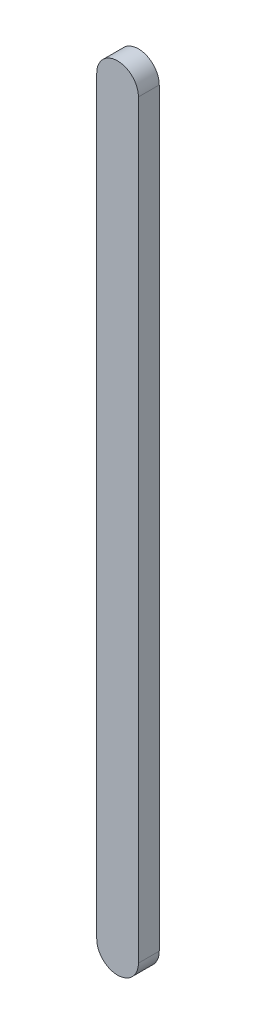
ISO-10303-21;
HEADER;
FILE_DESCRIPTION(('STEP AP214'),'2;1');
FILE_NAME('part.step','',(''),(''),'','','');
FILE_SCHEMA(('AUTOMOTIVE_DESIGN { 1 0 10303 214 1 1 1 1 }'));
ENDSEC;
DATA;
#1=APPLICATION_CONTEXT('core data for automotive mechanical design processes');
#2=APPLICATION_PROTOCOL_DEFINITION('international standard','automotive_design',2000,#1);
#3=PRODUCT_CONTEXT('',#1,'mechanical');
#4=PRODUCT('Part','Part','',(#3));
#5=PRODUCT_RELATED_PRODUCT_CATEGORY('part','',(#4));
#6=PRODUCT_DEFINITION_FORMATION('','',#4);
#7=PRODUCT_DEFINITION_CONTEXT('part definition',#1,'design');
#8=PRODUCT_DEFINITION('design','',#6,#7);
#9=PRODUCT_DEFINITION_SHAPE('','',#8);
#10=(LENGTH_UNIT() NAMED_UNIT(*) SI_UNIT(.MILLI.,.METRE.));
#11=(NAMED_UNIT(*) PLANE_ANGLE_UNIT() SI_UNIT($,.RADIAN.));
#12=(NAMED_UNIT(*) SI_UNIT($,.STERADIAN.) SOLID_ANGLE_UNIT());
#13=UNCERTAINTY_MEASURE_WITH_UNIT(LENGTH_MEASURE(1.E-05),#10,'distance_accuracy_value','');
#14=(GEOMETRIC_REPRESENTATION_CONTEXT(3) GLOBAL_UNCERTAINTY_ASSIGNED_CONTEXT((#13)) GLOBAL_UNIT_ASSIGNED_CONTEXT((#10,
#11,#12)) REPRESENTATION_CONTEXT('',''));
#15=CARTESIAN_POINT('',(0.,0.,0.));
#16=DIRECTION('',(0.,0.,1.));
#17=DIRECTION('',(1.,0.,0.));
#18=AXIS2_PLACEMENT_3D('',#15,#16,#17);
#19=CARTESIAN_POINT('',(0.,0.,5.));
#20=DIRECTION('',(0.,0.,-1.));
#21=DIRECTION('',(-1.,0.,0.));
#22=AXIS2_PLACEMENT_3D('',#19,#20,#21);
#23=CYLINDRICAL_SURFACE('',#22,5.);
#24=CARTESIAN_POINT('',(0.,0.,0.));
#25=DIRECTION('',(0.,0.,1.));
#26=DIRECTION('',(1.,0.,0.));
#27=AXIS2_PLACEMENT_3D('',#24,#25,#26);
#28=CIRCLE('',#27,5.);
#29=CARTESIAN_POINT('',(5.,0.,0.));
#30=VERTEX_POINT('',#29);
#31=CARTESIAN_POINT('',(-5.,0.,0.));
#32=VERTEX_POINT('',#31);
#33=EDGE_CURVE('E107',#30,#32,#28,.T.);
#34=ORIENTED_EDGE('',*,*,#33,.T.);
#35=DIRECTION('',(0.,0.,-1.));
#36=VECTOR('',#35,1.);
#37=CARTESIAN_POINT('',(-5.,0.,5.));
#38=LINE('',#37,#36);
#39=CARTESIAN_POINT('',(-5.,0.,5.));
#40=VERTEX_POINT('',#39);
#41=EDGE_CURVE('E11',#40,#32,#38,.T.);
#42=ORIENTED_EDGE('',*,*,#41,.F.);
#43=CARTESIAN_POINT('',(0.,0.,5.));
#44=DIRECTION('',(0.,0.,1.));
#45=DIRECTION('',(1.,0.,0.));
#46=AXIS2_PLACEMENT_3D('',#43,#44,#45);
#47=CIRCLE('',#46,5.);
#48=CARTESIAN_POINT('',(5.,0.,5.));
#49=VERTEX_POINT('',#48);
#50=EDGE_CURVE('E91',#49,#40,#47,.T.);
#51=ORIENTED_EDGE('',*,*,#50,.F.);
#52=DIRECTION('',(0.,0.,-1.));
#53=VECTOR('',#52,1.);
#54=CARTESIAN_POINT('',(5.,0.,5.));
#55=LINE('',#54,#53);
#56=EDGE_CURVE('E103',#49,#30,#55,.T.);
#57=ORIENTED_EDGE('',*,*,#56,.T.);
#58=EDGE_LOOP('',(#34,#42,#51,#57));
#59=FACE_BOUND('',#58,.T.);
#60=ADVANCED_FACE('F39',(#59),#23,.T.);
#61=CARTESIAN_POINT('',(-5.,0.,5.));
#62=DIRECTION('',(1.,0.,0.));
#63=DIRECTION('',(0.,1.,0.));
#64=AXIS2_PLACEMENT_3D('',#61,#62,#63);
#65=PLANE('',#64);
#66=DIRECTION('',(0.,-1.,0.));
#67=VECTOR('',#66,1.);
#68=CARTESIAN_POINT('',(-5.,0.,0.));
#69=LINE('',#68,#67);
#70=CARTESIAN_POINT('',(-4.99999999999998,-180.,0.));
#71=VERTEX_POINT('',#70);
#72=EDGE_CURVE('E96',#32,#71,#69,.T.);
#73=ORIENTED_EDGE('',*,*,#72,.T.);
#74=DIRECTION('',(0.,0.,-1.));
#75=VECTOR('',#74,1.);
#76=CARTESIAN_POINT('',(-4.99999999999998,-180.,5.));
#77=LINE('',#76,#75);
#78=CARTESIAN_POINT('',(-4.99999999999998,-180.,5.));
#79=VERTEX_POINT('',#78);
#80=EDGE_CURVE('E48',#79,#71,#77,.T.);
#81=ORIENTED_EDGE('',*,*,#80,.F.);
#82=DIRECTION('',(0.,-1.,0.));
#83=VECTOR('',#82,1.);
#84=CARTESIAN_POINT('',(-5.,0.,5.));
#85=LINE('',#84,#83);
#86=EDGE_CURVE('E86',#40,#79,#85,.T.);
#87=ORIENTED_EDGE('',*,*,#86,.F.);
#88=ORIENTED_EDGE('',*,*,#41,.T.);
#89=EDGE_LOOP('',(#73,#81,#87,#88));
#90=FACE_BOUND('',#89,.T.);
#91=ADVANCED_FACE('F95',(#90),#65,.F.);
#92=CARTESIAN_POINT('',(0.,-180.,5.));
#93=DIRECTION('',(0.,0.,-1.));
#94=DIRECTION('',(-1.,0.,0.));
#95=AXIS2_PLACEMENT_3D('',#92,#93,#94);
#96=CYLINDRICAL_SURFACE('',#95,5.);
#97=CARTESIAN_POINT('',(0.,-180.,0.));
#98=DIRECTION('',(0.,0.,1.));
#99=DIRECTION('',(1.,0.,0.));
#100=AXIS2_PLACEMENT_3D('',#97,#98,#99);
#101=CIRCLE('',#100,5.);
#102=CARTESIAN_POINT('',(5.00000000000002,-180.,0.));
#103=VERTEX_POINT('',#102);
#104=EDGE_CURVE('E73',#71,#103,#101,.T.);
#105=ORIENTED_EDGE('',*,*,#104,.T.);
#106=DIRECTION('',(0.,0.,-1.));
#107=VECTOR('',#106,1.);
#108=CARTESIAN_POINT('',(5.00000000000002,-180.,5.));
#109=LINE('',#108,#107);
#110=CARTESIAN_POINT('',(5.00000000000002,-180.,5.));
#111=VERTEX_POINT('',#110);
#112=EDGE_CURVE('E98',#111,#103,#109,.T.);
#113=ORIENTED_EDGE('',*,*,#112,.F.);
#114=CARTESIAN_POINT('',(0.,-180.,5.));
#115=DIRECTION('',(0.,0.,1.));
#116=DIRECTION('',(1.,0.,0.));
#117=AXIS2_PLACEMENT_3D('',#114,#115,#116);
#118=CIRCLE('',#117,5.);
#119=EDGE_CURVE('E89',#79,#111,#118,.T.);
#120=ORIENTED_EDGE('',*,*,#119,.F.);
#121=ORIENTED_EDGE('',*,*,#80,.T.);
#122=EDGE_LOOP('',(#105,#113,#120,#121));
#123=FACE_BOUND('',#122,.T.);
#124=ADVANCED_FACE('F99',(#123),#96,.T.);
#125=CARTESIAN_POINT('',(5.,0.,5.));
#126=DIRECTION('',(-1.,0.,0.));
#127=DIRECTION('',(0.,-1.,0.));
#128=AXIS2_PLACEMENT_3D('',#125,#126,#127);
#129=PLANE('',#128);
#130=DIRECTION('',(0.,1.,0.));
#131=VECTOR('',#130,1.);
#132=CARTESIAN_POINT('',(5.,0.,0.));
#133=LINE('',#132,#131);
#134=EDGE_CURVE('E79',#103,#30,#133,.T.);
#135=ORIENTED_EDGE('',*,*,#134,.T.);
#136=ORIENTED_EDGE('',*,*,#56,.F.);
#137=DIRECTION('',(0.,1.,0.));
#138=VECTOR('',#137,1.);
#139=CARTESIAN_POINT('',(5.,0.,5.));
#140=LINE('',#139,#138);
#141=EDGE_CURVE('E56',#111,#49,#140,.T.);
#142=ORIENTED_EDGE('',*,*,#141,.F.);
#143=ORIENTED_EDGE('',*,*,#112,.T.);
#144=EDGE_LOOP('',(#135,#136,#142,#143));
#145=FACE_BOUND('',#144,.T.);
#146=ADVANCED_FACE('F120',(#145),#129,.F.);
#147=CARTESIAN_POINT('',(0.,0.,5.));
#148=DIRECTION('',(0.,0.,1.));
#149=DIRECTION('',(1.,0.,0.));
#150=AXIS2_PLACEMENT_3D('',#147,#148,#149);
#151=PLANE('',#150);
#152=ORIENTED_EDGE('',*,*,#50,.T.);
#153=ORIENTED_EDGE('',*,*,#86,.T.);
#154=ORIENTED_EDGE('',*,*,#119,.T.);
#155=ORIENTED_EDGE('',*,*,#141,.T.);
#156=EDGE_LOOP('',(#152,#153,#154,#155));
#157=FACE_BOUND('',#156,.T.);
#158=ADVANCED_FACE('F87',(#157),#151,.T.);
#159=CARTESIAN_POINT('',(0.,0.,0.));
#160=DIRECTION('',(0.,0.,1.));
#161=DIRECTION('',(1.,0.,0.));
#162=AXIS2_PLACEMENT_3D('',#159,#160,#161);
#163=PLANE('',#162);
#164=ORIENTED_EDGE('',*,*,#33,.F.);
#165=ORIENTED_EDGE('',*,*,#134,.F.);
#166=ORIENTED_EDGE('',*,*,#104,.F.);
#167=ORIENTED_EDGE('',*,*,#72,.F.);
#168=EDGE_LOOP('',(#164,#165,#166,#167));
#169=FACE_BOUND('',#168,.T.);
#170=ADVANCED_FACE('F123',(#169),#163,.F.);
#171=CLOSED_SHELL('',(#60,#91,#124,#146,#158,#170));
#172=MANIFOLD_SOLID_BREP('B2',#171);
#173=ADVANCED_BREP_SHAPE_REPRESENTATION('',(#18,#172),#14);
#174=SHAPE_DEFINITION_REPRESENTATION(#9,#173);
ENDSEC;
END-ISO-10303-21;
